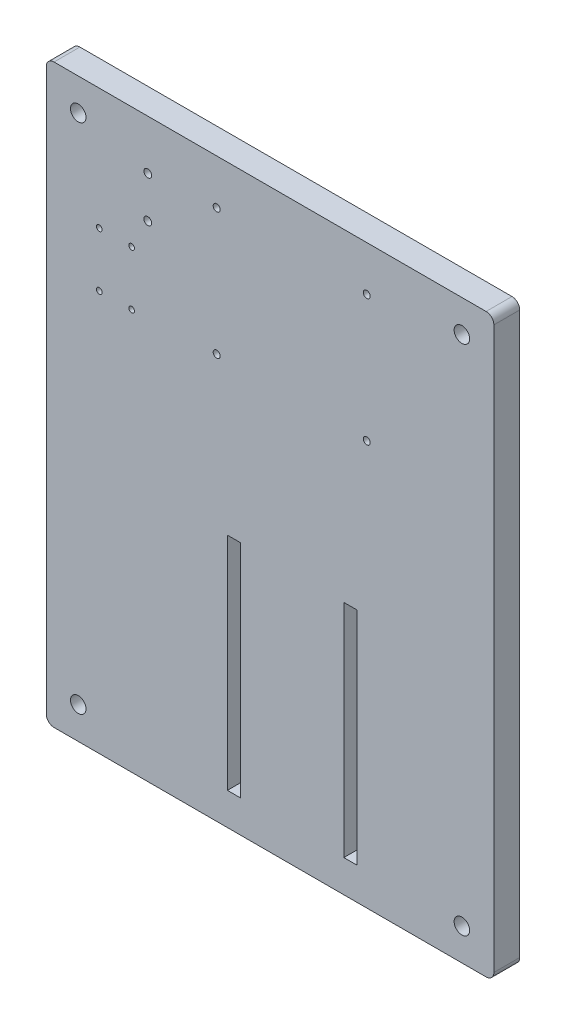
ISO-10303-21;
HEADER;
FILE_DESCRIPTION(('STEP AP214'),'2;1');
FILE_NAME('part.step','',(''),(''),'','','');
FILE_SCHEMA(('AUTOMOTIVE_DESIGN { 1 0 10303 214 1 1 1 1 }'));
ENDSEC;
DATA;
#1=APPLICATION_CONTEXT('core data for automotive mechanical design processes');
#2=APPLICATION_PROTOCOL_DEFINITION('international standard','automotive_design',2000,#1);
#3=PRODUCT_CONTEXT('',#1,'mechanical');
#4=PRODUCT('Part','Part','',(#3));
#5=PRODUCT_RELATED_PRODUCT_CATEGORY('part','',(#4));
#6=PRODUCT_DEFINITION_FORMATION('','',#4);
#7=PRODUCT_DEFINITION_CONTEXT('part definition',#1,'design');
#8=PRODUCT_DEFINITION('design','',#6,#7);
#9=PRODUCT_DEFINITION_SHAPE('','',#8);
#10=(LENGTH_UNIT() NAMED_UNIT(*) SI_UNIT(.MILLI.,.METRE.));
#11=(NAMED_UNIT(*) PLANE_ANGLE_UNIT() SI_UNIT($,.RADIAN.));
#12=(NAMED_UNIT(*) SI_UNIT($,.STERADIAN.) SOLID_ANGLE_UNIT());
#13=UNCERTAINTY_MEASURE_WITH_UNIT(LENGTH_MEASURE(1.E-05),#10,'distance_accuracy_value','');
#14=(GEOMETRIC_REPRESENTATION_CONTEXT(3) GLOBAL_UNCERTAINTY_ASSIGNED_CONTEXT((#13)) GLOBAL_UNIT_ASSIGNED_CONTEXT((#10,
#11,#12)) REPRESENTATION_CONTEXT('',''));
#15=CARTESIAN_POINT('',(0.,0.,0.));
#16=DIRECTION('',(0.,0.,1.));
#17=DIRECTION('',(1.,0.,0.));
#18=AXIS2_PLACEMENT_3D('',#15,#16,#17);
#19=CARTESIAN_POINT('',(-11.492,0.,10.));
#20=DIRECTION('',(-1.,0.,0.));
#21=DIRECTION('',(0.,0.,1.));
#22=AXIS2_PLACEMENT_3D('',#19,#20,#21);
#23=PLANE('',#22);
#24=DIRECTION('',(0.,1.,0.));
#25=VECTOR('',#24,1.);
#26=CARTESIAN_POINT('',(-11.492,0.,0.));
#27=LINE('',#26,#25);
#28=CARTESIAN_POINT('',(-11.492,-98.90673638,0.));
#29=VERTEX_POINT('',#28);
#30=CARTESIAN_POINT('',(-11.492,-13.488,0.));
#31=VERTEX_POINT('',#30);
#32=EDGE_CURVE('E265',#29,#31,#27,.T.);
#33=ORIENTED_EDGE('',*,*,#32,.F.);
#34=DIRECTION('',(0.,0.,-1.));
#35=VECTOR('',#34,1.);
#36=CARTESIAN_POINT('',(-11.492,-98.90673638,10.));
#37=LINE('',#36,#35);
#38=CARTESIAN_POINT('',(-11.492,-98.90673638,10.));
#39=VERTEX_POINT('',#38);
#40=EDGE_CURVE('E11',#39,#29,#37,.T.);
#41=ORIENTED_EDGE('',*,*,#40,.F.);
#42=DIRECTION('',(0.,1.,0.));
#43=VECTOR('',#42,1.);
#44=CARTESIAN_POINT('',(-11.492,0.,10.));
#45=LINE('',#44,#43);
#46=CARTESIAN_POINT('',(-11.492,-13.488,10.));
#47=VERTEX_POINT('',#46);
#48=EDGE_CURVE('E179',#39,#47,#45,.T.);
#49=ORIENTED_EDGE('',*,*,#48,.T.);
#50=DIRECTION('',(0.,0.,-1.));
#51=VECTOR('',#50,1.);
#52=CARTESIAN_POINT('',(-11.492,-13.488,10.));
#53=LINE('',#52,#51);
#54=EDGE_CURVE('E116',#47,#31,#53,.T.);
#55=ORIENTED_EDGE('',*,*,#54,.T.);
#56=EDGE_LOOP('',(#33,#41,#49,#55));
#57=FACE_BOUND('',#56,.T.);
#58=ADVANCED_FACE('F38',(#57),#23,.T.);
#59=CARTESIAN_POINT('',(0.,-98.90673638,10.));
#60=DIRECTION('',(0.,1.,0.));
#61=DIRECTION('',(0.,0.,1.));
#62=AXIS2_PLACEMENT_3D('',#59,#60,#61);
#63=PLANE('',#62);
#64=DIRECTION('',(1.,0.,0.));
#65=VECTOR('',#64,1.);
#66=CARTESIAN_POINT('',(0.,-98.90673638,0.));
#67=LINE('',#66,#65);
#68=CARTESIAN_POINT('',(-16.492,-98.90673638,0.));
#69=VERTEX_POINT('',#68);
#70=EDGE_CURVE('E168',#69,#29,#67,.T.);
#71=ORIENTED_EDGE('',*,*,#70,.F.);
#72=DIRECTION('',(0.,0.,-1.));
#73=VECTOR('',#72,1.);
#74=CARTESIAN_POINT('',(-16.492,-98.90673638,10.));
#75=LINE('',#74,#73);
#76=CARTESIAN_POINT('',(-16.492,-98.90673638,10.));
#77=VERTEX_POINT('',#76);
#78=EDGE_CURVE('E48',#77,#69,#75,.T.);
#79=ORIENTED_EDGE('',*,*,#78,.F.);
#80=DIRECTION('',(1.,0.,0.));
#81=VECTOR('',#80,1.);
#82=CARTESIAN_POINT('',(0.,-98.90673638,10.));
#83=LINE('',#82,#81);
#84=EDGE_CURVE('E166',#77,#39,#83,.T.);
#85=ORIENTED_EDGE('',*,*,#84,.T.);
#86=ORIENTED_EDGE('',*,*,#40,.T.);
#87=EDGE_LOOP('',(#71,#79,#85,#86));
#88=FACE_BOUND('',#87,.T.);
#89=ADVANCED_FACE('F164',(#88),#63,.T.);
#90=CARTESIAN_POINT('',(-16.492,0.,10.));
#91=DIRECTION('',(-1.,0.,0.));
#92=DIRECTION('',(0.,0.,1.));
#93=AXIS2_PLACEMENT_3D('',#90,#91,#92);
#94=PLANE('',#93);
#95=DIRECTION('',(0.,1.,0.));
#96=VECTOR('',#95,1.);
#97=CARTESIAN_POINT('',(-16.492,0.,0.));
#98=LINE('',#97,#96);
#99=CARTESIAN_POINT('',(-16.492,-13.488,0.));
#100=VERTEX_POINT('',#99);
#101=EDGE_CURVE('E268',#69,#100,#98,.T.);
#102=ORIENTED_EDGE('',*,*,#101,.T.);
#103=DIRECTION('',(0.,0.,-1.));
#104=VECTOR('',#103,1.);
#105=CARTESIAN_POINT('',(-16.492,-13.488,10.));
#106=LINE('',#105,#104);
#107=CARTESIAN_POINT('',(-16.492,-13.488,10.));
#108=VERTEX_POINT('',#107);
#109=EDGE_CURVE('E171',#108,#100,#106,.T.);
#110=ORIENTED_EDGE('',*,*,#109,.F.);
#111=DIRECTION('',(0.,1.,0.));
#112=VECTOR('',#111,1.);
#113=CARTESIAN_POINT('',(-16.492,0.,10.));
#114=LINE('',#113,#112);
#115=EDGE_CURVE('E174',#77,#108,#114,.T.);
#116=ORIENTED_EDGE('',*,*,#115,.F.);
#117=ORIENTED_EDGE('',*,*,#78,.T.);
#118=EDGE_LOOP('',(#102,#110,#116,#117));
#119=FACE_BOUND('',#118,.T.);
#120=ADVANCED_FACE('F175',(#119),#94,.F.);
#121=CARTESIAN_POINT('',(33.508,0.,10.));
#122=DIRECTION('',(-1.,0.,0.));
#123=DIRECTION('',(0.,0.,1.));
#124=AXIS2_PLACEMENT_3D('',#121,#122,#123);
#125=PLANE('',#124);
#126=DIRECTION('',(0.,1.,0.));
#127=VECTOR('',#126,1.);
#128=CARTESIAN_POINT('',(33.508,0.,0.));
#129=LINE('',#128,#127);
#130=CARTESIAN_POINT('',(33.508,-98.90673638,0.));
#131=VERTEX_POINT('',#130);
#132=CARTESIAN_POINT('',(33.508,-13.488,0.));
#133=VERTEX_POINT('',#132);
#134=EDGE_CURVE('E253',#131,#133,#129,.T.);
#135=ORIENTED_EDGE('',*,*,#134,.F.);
#136=DIRECTION('',(0.,0.,-1.));
#137=VECTOR('',#136,1.);
#138=CARTESIAN_POINT('',(33.508,-98.90673638,10.));
#139=LINE('',#138,#137);
#140=CARTESIAN_POINT('',(33.508,-98.90673638,10.));
#141=VERTEX_POINT('',#140);
#142=EDGE_CURVE('E309',#141,#131,#139,.T.);
#143=ORIENTED_EDGE('',*,*,#142,.F.);
#144=DIRECTION('',(0.,1.,0.));
#145=VECTOR('',#144,1.);
#146=CARTESIAN_POINT('',(33.508,0.,10.));
#147=LINE('',#146,#145);
#148=CARTESIAN_POINT('',(33.508,-13.488,10.));
#149=VERTEX_POINT('',#148);
#150=EDGE_CURVE('E372',#141,#149,#147,.T.);
#151=ORIENTED_EDGE('',*,*,#150,.T.);
#152=DIRECTION('',(0.,0.,-1.));
#153=VECTOR('',#152,1.);
#154=CARTESIAN_POINT('',(33.508,-13.488,10.));
#155=LINE('',#154,#153);
#156=EDGE_CURVE('E311',#149,#133,#155,.T.);
#157=ORIENTED_EDGE('',*,*,#156,.T.);
#158=EDGE_LOOP('',(#135,#143,#151,#157));
#159=FACE_BOUND('',#158,.T.);
#160=ADVANCED_FACE('F390',(#159),#125,.T.);
#161=CARTESIAN_POINT('',(0.,-98.90673638,10.));
#162=DIRECTION('',(0.,1.,0.));
#163=DIRECTION('',(0.,0.,1.));
#164=AXIS2_PLACEMENT_3D('',#161,#162,#163);
#165=PLANE('',#164);
#166=DIRECTION('',(1.,0.,0.));
#167=VECTOR('',#166,1.);
#168=CARTESIAN_POINT('',(0.,-98.90673638,0.));
#169=LINE('',#168,#167);
#170=CARTESIAN_POINT('',(28.508,-98.90673638,0.));
#171=VERTEX_POINT('',#170);
#172=EDGE_CURVE('E256',#171,#131,#169,.T.);
#173=ORIENTED_EDGE('',*,*,#172,.F.);
#174=DIRECTION('',(0.,0.,-1.));
#175=VECTOR('',#174,1.);
#176=CARTESIAN_POINT('',(28.508,-98.90673638,10.));
#177=LINE('',#176,#175);
#178=CARTESIAN_POINT('',(28.508,-98.90673638,10.));
#179=VERTEX_POINT('',#178);
#180=EDGE_CURVE('E316',#179,#171,#177,.T.);
#181=ORIENTED_EDGE('',*,*,#180,.F.);
#182=DIRECTION('',(1.,0.,0.));
#183=VECTOR('',#182,1.);
#184=CARTESIAN_POINT('',(0.,-98.90673638,10.));
#185=LINE('',#184,#183);
#186=EDGE_CURVE('E375',#179,#141,#185,.T.);
#187=ORIENTED_EDGE('',*,*,#186,.T.);
#188=ORIENTED_EDGE('',*,*,#142,.T.);
#189=EDGE_LOOP('',(#173,#181,#187,#188));
#190=FACE_BOUND('',#189,.T.);
#191=ADVANCED_FACE('F393',(#190),#165,.T.);
#192=CARTESIAN_POINT('',(28.508,0.,10.));
#193=DIRECTION('',(-1.,0.,0.));
#194=DIRECTION('',(0.,0.,1.));
#195=AXIS2_PLACEMENT_3D('',#192,#193,#194);
#196=PLANE('',#195);
#197=DIRECTION('',(0.,1.,0.));
#198=VECTOR('',#197,1.);
#199=CARTESIAN_POINT('',(28.508,0.,0.));
#200=LINE('',#199,#198);
#201=CARTESIAN_POINT('',(28.508,-13.488,0.));
#202=VERTEX_POINT('',#201);
#203=EDGE_CURVE('E259',#171,#202,#200,.T.);
#204=ORIENTED_EDGE('',*,*,#203,.T.);
#205=DIRECTION('',(0.,0.,-1.));
#206=VECTOR('',#205,1.);
#207=CARTESIAN_POINT('',(28.508,-13.488,10.));
#208=LINE('',#207,#206);
#209=CARTESIAN_POINT('',(28.508,-13.488,10.));
#210=VERTEX_POINT('',#209);
#211=EDGE_CURVE('E313',#210,#202,#208,.T.);
#212=ORIENTED_EDGE('',*,*,#211,.F.);
#213=DIRECTION('',(0.,1.,0.));
#214=VECTOR('',#213,1.);
#215=CARTESIAN_POINT('',(28.508,0.,10.));
#216=LINE('',#215,#214);
#217=EDGE_CURVE('E378',#179,#210,#216,.T.);
#218=ORIENTED_EDGE('',*,*,#217,.F.);
#219=ORIENTED_EDGE('',*,*,#180,.T.);
#220=EDGE_LOOP('',(#204,#212,#218,#219));
#221=FACE_BOUND('',#220,.T.);
#222=ADVANCED_FACE('F396',(#221),#196,.F.);
#223=CARTESIAN_POINT('',(83.492,108.366,10.));
#224=DIRECTION('',(0.,0.,-1.));
#225=DIRECTION('',(-1.,0.,0.));
#226=AXIS2_PLACEMENT_3D('',#223,#224,#225);
#227=CYLINDRICAL_SURFACE('',#226,3.);
#228=CARTESIAN_POINT('',(83.492,108.366,0.));
#229=DIRECTION('',(0.,0.,1.));
#230=DIRECTION('',(1.,0.,0.));
#231=AXIS2_PLACEMENT_3D('',#228,#229,#230);
#232=CIRCLE('',#231,3.);
#233=CARTESIAN_POINT('',(83.492,111.366,0.));
#234=VERTEX_POINT('',#233);
#235=CARTESIAN_POINT('',(86.492,108.366,0.));
#236=VERTEX_POINT('',#235);
#237=EDGE_CURVE('E229',#234,#236,#232,.F.);
#238=ORIENTED_EDGE('',*,*,#237,.F.);
#239=DIRECTION('',(0.,0.,-1.));
#240=VECTOR('',#239,1.);
#241=CARTESIAN_POINT('',(83.492,111.366,10.));
#242=LINE('',#241,#240);
#243=CARTESIAN_POINT('',(83.492,111.366,10.));
#244=VERTEX_POINT('',#243);
#245=EDGE_CURVE('E42',#244,#234,#242,.T.);
#246=ORIENTED_EDGE('',*,*,#245,.F.);
#247=CARTESIAN_POINT('',(83.492,108.366,10.));
#248=DIRECTION('',(0.,0.,1.));
#249=DIRECTION('',(1.,0.,0.));
#250=AXIS2_PLACEMENT_3D('',#247,#248,#249);
#251=CIRCLE('',#250,3.);
#252=CARTESIAN_POINT('',(86.492,108.366,10.));
#253=VERTEX_POINT('',#252);
#254=EDGE_CURVE('E490',#244,#253,#251,.F.);
#255=ORIENTED_EDGE('',*,*,#254,.T.);
#256=DIRECTION('',(0.,0.,-1.));
#257=VECTOR('',#256,1.);
#258=CARTESIAN_POINT('',(86.492,108.366,10.));
#259=LINE('',#258,#257);
#260=EDGE_CURVE('E222',#253,#236,#259,.T.);
#261=ORIENTED_EDGE('',*,*,#260,.T.);
#262=EDGE_LOOP('',(#238,#246,#255,#261));
#263=FACE_BOUND('',#262,.T.);
#264=ADVANCED_FACE('F341',(#263),#227,.T.);
#265=CARTESIAN_POINT('',(0.,111.366,10.));
#266=DIRECTION('',(0.,1.,0.));
#267=DIRECTION('',(0.,0.,1.));
#268=AXIS2_PLACEMENT_3D('',#265,#266,#267);
#269=PLANE('',#268);
#270=DIRECTION('',(1.,0.,0.));
#271=VECTOR('',#270,1.);
#272=CARTESIAN_POINT('',(0.,111.366,0.));
#273=LINE('',#272,#271);
#274=CARTESIAN_POINT('',(-83.492,111.366,0.));
#275=VERTEX_POINT('',#274);
#276=EDGE_CURVE('E232',#275,#234,#273,.T.);
#277=ORIENTED_EDGE('',*,*,#276,.F.);
#278=DIRECTION('',(0.,0.,-1.));
#279=VECTOR('',#278,1.);
#280=CARTESIAN_POINT('',(-83.492,111.366,10.));
#281=LINE('',#280,#279);
#282=CARTESIAN_POINT('',(-83.492,111.366,10.));
#283=VERTEX_POINT('',#282);
#284=EDGE_CURVE('E331',#283,#275,#281,.T.);
#285=ORIENTED_EDGE('',*,*,#284,.F.);
#286=DIRECTION('',(1.,0.,0.));
#287=VECTOR('',#286,1.);
#288=CARTESIAN_POINT('',(0.,111.366,10.));
#289=LINE('',#288,#287);
#290=EDGE_CURVE('E340',#283,#244,#289,.T.);
#291=ORIENTED_EDGE('',*,*,#290,.T.);
#292=ORIENTED_EDGE('',*,*,#245,.T.);
#293=EDGE_LOOP('',(#277,#285,#291,#292));
#294=FACE_BOUND('',#293,.T.);
#295=ADVANCED_FACE('F338',(#294),#269,.T.);
#296=CARTESIAN_POINT('',(-83.492,108.366,10.));
#297=DIRECTION('',(0.,0.,-1.));
#298=DIRECTION('',(-1.,0.,0.));
#299=AXIS2_PLACEMENT_3D('',#296,#297,#298);
#300=CYLINDRICAL_SURFACE('',#299,3.);
#301=CARTESIAN_POINT('',(-83.492,108.366,0.));
#302=DIRECTION('',(0.,0.,1.));
#303=DIRECTION('',(1.,0.,0.));
#304=AXIS2_PLACEMENT_3D('',#301,#302,#303);
#305=CIRCLE('',#304,3.);
#306=CARTESIAN_POINT('',(-86.492,108.366,0.));
#307=VERTEX_POINT('',#306);
#308=EDGE_CURVE('E235',#275,#307,#305,.T.);
#309=ORIENTED_EDGE('',*,*,#308,.T.);
#310=DIRECTION('',(0.,0.,-1.));
#311=VECTOR('',#310,1.);
#312=CARTESIAN_POINT('',(-86.492,108.366,10.));
#313=LINE('',#312,#311);
#314=CARTESIAN_POINT('',(-86.492,108.366,10.));
#315=VERTEX_POINT('',#314);
#316=EDGE_CURVE('E330',#315,#307,#313,.T.);
#317=ORIENTED_EDGE('',*,*,#316,.F.);
#318=CARTESIAN_POINT('',(-83.492,108.366,10.));
#319=DIRECTION('',(0.,0.,1.));
#320=DIRECTION('',(1.,0.,0.));
#321=AXIS2_PLACEMENT_3D('',#318,#319,#320);
#322=CIRCLE('',#321,3.);
#323=EDGE_CURVE('E350',#283,#315,#322,.T.);
#324=ORIENTED_EDGE('',*,*,#323,.F.);
#325=ORIENTED_EDGE('',*,*,#284,.T.);
#326=EDGE_LOOP('',(#309,#317,#324,#325));
#327=FACE_BOUND('',#326,.T.);
#328=ADVANCED_FACE('F348',(#327),#300,.T.);
#329=CARTESIAN_POINT('',(-86.492,0.,10.));
#330=DIRECTION('',(-1.,0.,0.));
#331=DIRECTION('',(0.,0.,1.));
#332=AXIS2_PLACEMENT_3D('',#329,#330,#331);
#333=PLANE('',#332);
#334=DIRECTION('',(0.,1.,0.));
#335=VECTOR('',#334,1.);
#336=CARTESIAN_POINT('',(-86.492,0.,0.));
#337=LINE('',#336,#335);
#338=CARTESIAN_POINT('',(-86.492,-108.366,0.));
#339=VERTEX_POINT('',#338);
#340=EDGE_CURVE('E238',#339,#307,#337,.T.);
#341=ORIENTED_EDGE('',*,*,#340,.F.);
#342=DIRECTION('',(0.,0.,-1.));
#343=VECTOR('',#342,1.);
#344=CARTESIAN_POINT('',(-86.492,-108.366,10.));
#345=LINE('',#344,#343);
#346=CARTESIAN_POINT('',(-86.492,-108.366,10.));
#347=VERTEX_POINT('',#346);
#348=EDGE_CURVE('E328',#347,#339,#345,.T.);
#349=ORIENTED_EDGE('',*,*,#348,.F.);
#350=DIRECTION('',(0.,1.,0.));
#351=VECTOR('',#350,1.);
#352=CARTESIAN_POINT('',(-86.492,0.,10.));
#353=LINE('',#352,#351);
#354=EDGE_CURVE('E353',#347,#315,#353,.T.);
#355=ORIENTED_EDGE('',*,*,#354,.T.);
#356=ORIENTED_EDGE('',*,*,#316,.T.);
#357=EDGE_LOOP('',(#341,#349,#355,#356));
#358=FACE_BOUND('',#357,.T.);
#359=ADVANCED_FACE('F354',(#358),#333,.T.);
#360=CARTESIAN_POINT('',(-83.492,-108.366,10.));
#361=DIRECTION('',(0.,0.,-1.));
#362=DIRECTION('',(-1.,0.,0.));
#363=AXIS2_PLACEMENT_3D('',#360,#361,#362);
#364=CYLINDRICAL_SURFACE('',#363,3.);
#365=CARTESIAN_POINT('',(-83.492,-108.366,0.));
#366=DIRECTION('',(0.,0.,1.));
#367=DIRECTION('',(1.,0.,0.));
#368=AXIS2_PLACEMENT_3D('',#365,#366,#367);
#369=CIRCLE('',#368,3.);
#370=CARTESIAN_POINT('',(-83.492,-111.366,0.));
#371=VERTEX_POINT('',#370);
#372=EDGE_CURVE('E241',#371,#339,#369,.F.);
#373=ORIENTED_EDGE('',*,*,#372,.F.);
#374=DIRECTION('',(0.,0.,-1.));
#375=VECTOR('',#374,1.);
#376=CARTESIAN_POINT('',(-83.492,-111.366,10.));
#377=LINE('',#376,#375);
#378=CARTESIAN_POINT('',(-83.492,-111.366,10.));
#379=VERTEX_POINT('',#378);
#380=EDGE_CURVE('E326',#379,#371,#377,.T.);
#381=ORIENTED_EDGE('',*,*,#380,.F.);
#382=CARTESIAN_POINT('',(-83.492,-108.366,10.));
#383=DIRECTION('',(0.,0.,1.));
#384=DIRECTION('',(1.,0.,0.));
#385=AXIS2_PLACEMENT_3D('',#382,#383,#384);
#386=CIRCLE('',#385,3.);
#387=EDGE_CURVE('E358',#379,#347,#386,.F.);
#388=ORIENTED_EDGE('',*,*,#387,.T.);
#389=ORIENTED_EDGE('',*,*,#348,.T.);
#390=EDGE_LOOP('',(#373,#381,#388,#389));
#391=FACE_BOUND('',#390,.T.);
#392=ADVANCED_FACE('F467',(#391),#364,.T.);
#393=CARTESIAN_POINT('',(0.,-111.366,10.));
#394=DIRECTION('',(0.,1.,0.));
#395=DIRECTION('',(0.,0.,1.));
#396=AXIS2_PLACEMENT_3D('',#393,#394,#395);
#397=PLANE('',#396);
#398=DIRECTION('',(1.,0.,0.));
#399=VECTOR('',#398,1.);
#400=CARTESIAN_POINT('',(0.,-111.366,0.));
#401=LINE('',#400,#399);
#402=CARTESIAN_POINT('',(83.492,-111.366,0.));
#403=VERTEX_POINT('',#402);
#404=EDGE_CURVE('E244',#371,#403,#401,.T.);
#405=ORIENTED_EDGE('',*,*,#404,.T.);
#406=DIRECTION('',(0.,0.,-1.));
#407=VECTOR('',#406,1.);
#408=CARTESIAN_POINT('',(83.492,-111.366,10.));
#409=LINE('',#408,#407);
#410=CARTESIAN_POINT('',(83.492,-111.366,10.));
#411=VERTEX_POINT('',#410);
#412=EDGE_CURVE('E323',#411,#403,#409,.T.);
#413=ORIENTED_EDGE('',*,*,#412,.F.);
#414=DIRECTION('',(1.,0.,0.));
#415=VECTOR('',#414,1.);
#416=CARTESIAN_POINT('',(0.,-111.366,10.));
#417=LINE('',#416,#415);
#418=EDGE_CURVE('E360',#379,#411,#417,.T.);
#419=ORIENTED_EDGE('',*,*,#418,.F.);
#420=ORIENTED_EDGE('',*,*,#380,.T.);
#421=EDGE_LOOP('',(#405,#413,#419,#420));
#422=FACE_BOUND('',#421,.T.);
#423=ADVANCED_FACE('F463',(#422),#397,.F.);
#424=CARTESIAN_POINT('',(83.492,-108.366,10.));
#425=DIRECTION('',(0.,0.,-1.));
#426=DIRECTION('',(-1.,0.,0.));
#427=AXIS2_PLACEMENT_3D('',#424,#425,#426);
#428=CYLINDRICAL_SURFACE('',#427,3.);
#429=CARTESIAN_POINT('',(83.492,-108.366,0.));
#430=DIRECTION('',(0.,0.,1.));
#431=DIRECTION('',(1.,0.,0.));
#432=AXIS2_PLACEMENT_3D('',#429,#430,#431);
#433=CIRCLE('',#432,3.);
#434=CARTESIAN_POINT('',(86.492,-108.366,0.));
#435=VERTEX_POINT('',#434);
#436=EDGE_CURVE('E247',#403,#435,#433,.T.);
#437=ORIENTED_EDGE('',*,*,#436,.T.);
#438=DIRECTION('',(0.,0.,-1.));
#439=VECTOR('',#438,1.);
#440=CARTESIAN_POINT('',(86.492,-108.366,10.));
#441=LINE('',#440,#439);
#442=CARTESIAN_POINT('',(86.492,-108.366,10.));
#443=VERTEX_POINT('',#442);
#444=EDGE_CURVE('E320',#443,#435,#441,.T.);
#445=ORIENTED_EDGE('',*,*,#444,.F.);
#446=CARTESIAN_POINT('',(83.492,-108.366,10.));
#447=DIRECTION('',(0.,0.,1.));
#448=DIRECTION('',(1.,0.,0.));
#449=AXIS2_PLACEMENT_3D('',#446,#447,#448);
#450=CIRCLE('',#449,3.);
#451=EDGE_CURVE('E367',#411,#443,#450,.T.);
#452=ORIENTED_EDGE('',*,*,#451,.F.);
#453=ORIENTED_EDGE('',*,*,#412,.T.);
#454=EDGE_LOOP('',(#437,#445,#452,#453));
#455=FACE_BOUND('',#454,.T.);
#456=ADVANCED_FACE('F459',(#455),#428,.T.);
#457=CARTESIAN_POINT('',(37.364,45.012,10.));
#458=DIRECTION('',(0.,0.,-1.));
#459=DIRECTION('',(-1.,0.,0.));
#460=AXIS2_PLACEMENT_3D('',#457,#458,#459);
#461=CYLINDRICAL_SURFACE('',#460,1.35);
#462=CARTESIAN_POINT('',(37.364,45.012,10.));
#463=DIRECTION('',(0.,0.,1.));
#464=DIRECTION('',(1.,0.,0.));
#465=AXIS2_PLACEMENT_3D('',#462,#463,#464);
#466=CIRCLE('',#465,1.35);
#467=CARTESIAN_POINT('',(38.714,45.012,10.));
#468=VERTEX_POINT('',#467);
#469=EDGE_CURVE('E216',#468,#468,#466,.T.);
#470=ORIENTED_EDGE('',*,*,#469,.T.);
#471=EDGE_LOOP('',(#470));
#472=FACE_BOUND('',#471,.T.);
#473=CARTESIAN_POINT('',(37.364,45.012,0.));
#474=DIRECTION('',(0.,0.,1.));
#475=DIRECTION('',(1.,0.,0.));
#476=AXIS2_PLACEMENT_3D('',#473,#474,#475);
#477=CIRCLE('',#476,1.35);
#478=CARTESIAN_POINT('',(38.714,45.012,0.));
#479=VERTEX_POINT('',#478);
#480=EDGE_CURVE('E301',#479,#479,#477,.T.);
#481=ORIENTED_EDGE('',*,*,#480,.F.);
#482=EDGE_LOOP('',(#481));
#483=FACE_BOUND('',#482,.T.);
#484=ADVANCED_FACE('F462',(#472,#483),#461,.F.);
#485=CARTESIAN_POINT('',(37.364,94.012,10.));
#486=DIRECTION('',(0.,0.,-1.));
#487=DIRECTION('',(-1.,0.,0.));
#488=AXIS2_PLACEMENT_3D('',#485,#486,#487);
#489=CYLINDRICAL_SURFACE('',#488,1.35);
#490=CARTESIAN_POINT('',(37.364,94.012,10.));
#491=DIRECTION('',(0.,0.,1.));
#492=DIRECTION('',(1.,0.,0.));
#493=AXIS2_PLACEMENT_3D('',#490,#491,#492);
#494=CIRCLE('',#493,1.35);
#495=CARTESIAN_POINT('',(38.714,94.012,10.));
#496=VERTEX_POINT('',#495);
#497=EDGE_CURVE('E213',#496,#496,#494,.T.);
#498=ORIENTED_EDGE('',*,*,#497,.T.);
#499=EDGE_LOOP('',(#498));
#500=FACE_BOUND('',#499,.T.);
#501=CARTESIAN_POINT('',(37.364,94.012,0.));
#502=DIRECTION('',(0.,0.,1.));
#503=DIRECTION('',(1.,0.,0.));
#504=AXIS2_PLACEMENT_3D('',#501,#502,#503);
#505=CIRCLE('',#504,1.35);
#506=CARTESIAN_POINT('',(38.714,94.012,0.));
#507=VERTEX_POINT('',#506);
#508=EDGE_CURVE('E298',#507,#507,#505,.T.);
#509=ORIENTED_EDGE('',*,*,#508,.F.);
#510=EDGE_LOOP('',(#509));
#511=FACE_BOUND('',#510,.T.);
#512=ADVANCED_FACE('F661',(#500,#511),#489,.F.);
#513=CARTESIAN_POINT('',(-20.636,94.012,10.));
#514=DIRECTION('',(0.,0.,-1.));
#515=DIRECTION('',(-1.,0.,0.));
#516=AXIS2_PLACEMENT_3D('',#513,#514,#515);
#517=CYLINDRICAL_SURFACE('',#516,1.35);
#518=CARTESIAN_POINT('',(-20.636,94.012,10.));
#519=DIRECTION('',(0.,0.,1.));
#520=DIRECTION('',(1.,0.,0.));
#521=AXIS2_PLACEMENT_3D('',#518,#519,#520);
#522=CIRCLE('',#521,1.35);
#523=CARTESIAN_POINT('',(-19.286,94.012,10.));
#524=VERTEX_POINT('',#523);
#525=EDGE_CURVE('E210',#524,#524,#522,.T.);
#526=ORIENTED_EDGE('',*,*,#525,.T.);
#527=EDGE_LOOP('',(#526));
#528=FACE_BOUND('',#527,.T.);
#529=CARTESIAN_POINT('',(-20.636,94.012,0.));
#530=DIRECTION('',(0.,0.,1.));
#531=DIRECTION('',(1.,0.,0.));
#532=AXIS2_PLACEMENT_3D('',#529,#530,#531);
#533=CIRCLE('',#532,1.35);
#534=CARTESIAN_POINT('',(-19.286,94.012,0.));
#535=VERTEX_POINT('',#534);
#536=EDGE_CURVE('E295',#535,#535,#533,.T.);
#537=ORIENTED_EDGE('',*,*,#536,.F.);
#538=EDGE_LOOP('',(#537));
#539=FACE_BOUND('',#538,.T.);
#540=ADVANCED_FACE('F651',(#528,#539),#517,.F.);
#541=CARTESIAN_POINT('',(-65.998,64.512,10.));
#542=DIRECTION('',(0.,0.,-1.));
#543=DIRECTION('',(-1.,0.,0.));
#544=AXIS2_PLACEMENT_3D('',#541,#542,#543);
#545=CYLINDRICAL_SURFACE('',#544,1.10000000000001);
#546=CARTESIAN_POINT('',(-65.998,64.512,10.));
#547=DIRECTION('',(0.,0.,1.));
#548=DIRECTION('',(1.,0.,0.));
#549=AXIS2_PLACEMENT_3D('',#546,#547,#548);
#550=CIRCLE('',#549,1.10000000000001);
#551=CARTESIAN_POINT('',(-64.898,64.512,10.));
#552=VERTEX_POINT('',#551);
#553=EDGE_CURVE('E207',#552,#552,#550,.F.);
#554=ORIENTED_EDGE('',*,*,#553,.F.);
#555=EDGE_LOOP('',(#554));
#556=FACE_BOUND('',#555,.T.);
#557=CARTESIAN_POINT('',(-65.998,64.512,0.));
#558=DIRECTION('',(0.,0.,1.));
#559=DIRECTION('',(1.,0.,0.));
#560=AXIS2_PLACEMENT_3D('',#557,#558,#559);
#561=CIRCLE('',#560,1.10000000000001);
#562=CARTESIAN_POINT('',(-64.898,64.512,0.));
#563=VERTEX_POINT('',#562);
#564=EDGE_CURVE('E292',#563,#563,#561,.F.);
#565=ORIENTED_EDGE('',*,*,#564,.T.);
#566=EDGE_LOOP('',(#565));
#567=FACE_BOUND('',#566,.T.);
#568=ADVANCED_FACE('F641',(#556,#567),#545,.F.);
#569=CARTESIAN_POINT('',(-65.998,43.512,10.));
#570=DIRECTION('',(0.,0.,-1.));
#571=DIRECTION('',(-1.,0.,0.));
#572=AXIS2_PLACEMENT_3D('',#569,#570,#571);
#573=CYLINDRICAL_SURFACE('',#572,1.10000000000001);
#574=CARTESIAN_POINT('',(-65.998,43.512,10.));
#575=DIRECTION('',(0.,0.,1.));
#576=DIRECTION('',(1.,0.,0.));
#577=AXIS2_PLACEMENT_3D('',#574,#575,#576);
#578=CIRCLE('',#577,1.10000000000001);
#579=CARTESIAN_POINT('',(-64.898,43.512,10.));
#580=VERTEX_POINT('',#579);
#581=EDGE_CURVE('E204',#580,#580,#578,.T.);
#582=ORIENTED_EDGE('',*,*,#581,.T.);
#583=EDGE_LOOP('',(#582));
#584=FACE_BOUND('',#583,.T.);
#585=CARTESIAN_POINT('',(-65.998,43.512,0.));
#586=DIRECTION('',(0.,0.,1.));
#587=DIRECTION('',(1.,0.,0.));
#588=AXIS2_PLACEMENT_3D('',#585,#586,#587);
#589=CIRCLE('',#588,1.10000000000001);
#590=CARTESIAN_POINT('',(-64.898,43.512,0.));
#591=VERTEX_POINT('',#590);
#592=EDGE_CURVE('E289',#591,#591,#589,.T.);
#593=ORIENTED_EDGE('',*,*,#592,.F.);
#594=EDGE_LOOP('',(#593));
#595=FACE_BOUND('',#594,.T.);
#596=ADVANCED_FACE('F631',(#584,#595),#573,.F.);
#597=CARTESIAN_POINT('',(-53.498,43.512,10.));
#598=DIRECTION('',(0.,0.,-1.));
#599=DIRECTION('',(-1.,0.,0.));
#600=AXIS2_PLACEMENT_3D('',#597,#598,#599);
#601=CYLINDRICAL_SURFACE('',#600,1.1);
#602=CARTESIAN_POINT('',(-53.498,43.512,10.));
#603=DIRECTION('',(0.,0.,1.));
#604=DIRECTION('',(1.,0.,0.));
#605=AXIS2_PLACEMENT_3D('',#602,#603,#604);
#606=CIRCLE('',#605,1.1);
#607=CARTESIAN_POINT('',(-52.398,43.512,10.));
#608=VERTEX_POINT('',#607);
#609=EDGE_CURVE('E201',#608,#608,#606,.T.);
#610=ORIENTED_EDGE('',*,*,#609,.T.);
#611=EDGE_LOOP('',(#610));
#612=FACE_BOUND('',#611,.T.);
#613=CARTESIAN_POINT('',(-53.498,43.512,0.));
#614=DIRECTION('',(0.,0.,1.));
#615=DIRECTION('',(1.,0.,0.));
#616=AXIS2_PLACEMENT_3D('',#613,#614,#615);
#617=CIRCLE('',#616,1.1);
#618=CARTESIAN_POINT('',(-52.398,43.512,0.));
#619=VERTEX_POINT('',#618);
#620=EDGE_CURVE('E286',#619,#619,#617,.T.);
#621=ORIENTED_EDGE('',*,*,#620,.F.);
#622=EDGE_LOOP('',(#621));
#623=FACE_BOUND('',#622,.T.);
#624=ADVANCED_FACE('F621',(#612,#623),#601,.F.);
#625=CARTESIAN_POINT('',(-53.498,64.512,10.));
#626=DIRECTION('',(0.,0.,-1.));
#627=DIRECTION('',(-1.,0.,0.));
#628=AXIS2_PLACEMENT_3D('',#625,#626,#627);
#629=CYLINDRICAL_SURFACE('',#628,1.1);
#630=CARTESIAN_POINT('',(-53.498,64.512,10.));
#631=DIRECTION('',(0.,0.,1.));
#632=DIRECTION('',(1.,0.,0.));
#633=AXIS2_PLACEMENT_3D('',#630,#631,#632);
#634=CIRCLE('',#633,1.1);
#635=CARTESIAN_POINT('',(-52.398,64.512,10.));
#636=VERTEX_POINT('',#635);
#637=EDGE_CURVE('E198',#636,#636,#634,.F.);
#638=ORIENTED_EDGE('',*,*,#637,.F.);
#639=EDGE_LOOP('',(#638));
#640=FACE_BOUND('',#639,.T.);
#641=CARTESIAN_POINT('',(-53.498,64.512,0.));
#642=DIRECTION('',(0.,0.,1.));
#643=DIRECTION('',(1.,0.,0.));
#644=AXIS2_PLACEMENT_3D('',#641,#642,#643);
#645=CIRCLE('',#644,1.1);
#646=CARTESIAN_POINT('',(-52.398,64.512,0.));
#647=VERTEX_POINT('',#646);
#648=EDGE_CURVE('E283',#647,#647,#645,.F.);
#649=ORIENTED_EDGE('',*,*,#648,.T.);
#650=EDGE_LOOP('',(#649));
#651=FACE_BOUND('',#650,.T.);
#652=ADVANCED_FACE('F611',(#640,#651),#629,.F.);
#653=CARTESIAN_POINT('',(-47.26410382,76.25530339,10.));
#654=DIRECTION('',(0.,0.,-1.));
#655=DIRECTION('',(-1.,0.,0.));
#656=AXIS2_PLACEMENT_3D('',#653,#654,#655);
#657=CYLINDRICAL_SURFACE('',#656,1.5);
#658=CARTESIAN_POINT('',(-47.26410382,76.25530339,10.));
#659=DIRECTION('',(0.,0.,1.));
#660=DIRECTION('',(1.,0.,0.));
#661=AXIS2_PLACEMENT_3D('',#658,#659,#660);
#662=CIRCLE('',#661,1.5);
#663=CARTESIAN_POINT('',(-45.76410382,76.25530339,10.));
#664=VERTEX_POINT('',#663);
#665=EDGE_CURVE('E195',#664,#664,#662,.F.);
#666=ORIENTED_EDGE('',*,*,#665,.F.);
#667=EDGE_LOOP('',(#666));
#668=FACE_BOUND('',#667,.T.);
#669=CARTESIAN_POINT('',(-47.26410382,76.25530339,0.));
#670=DIRECTION('',(0.,0.,1.));
#671=DIRECTION('',(1.,0.,0.));
#672=AXIS2_PLACEMENT_3D('',#669,#670,#671);
#673=CIRCLE('',#672,1.5);
#674=CARTESIAN_POINT('',(-45.76410382,76.25530339,0.));
#675=VERTEX_POINT('',#674);
#676=EDGE_CURVE('E280',#675,#675,#673,.F.);
#677=ORIENTED_EDGE('',*,*,#676,.T.);
#678=EDGE_LOOP('',(#677));
#679=FACE_BOUND('',#678,.T.);
#680=ADVANCED_FACE('F601',(#668,#679),#657,.F.);
#681=CARTESIAN_POINT('',(-47.26410382,92.23269661,10.));
#682=DIRECTION('',(0.,0.,-1.));
#683=DIRECTION('',(-1.,0.,0.));
#684=AXIS2_PLACEMENT_3D('',#681,#682,#683);
#685=CYLINDRICAL_SURFACE('',#684,1.5);
#686=CARTESIAN_POINT('',(-47.26410382,92.23269661,10.));
#687=DIRECTION('',(0.,0.,1.));
#688=DIRECTION('',(1.,0.,0.));
#689=AXIS2_PLACEMENT_3D('',#686,#687,#688);
#690=CIRCLE('',#689,1.5);
#691=CARTESIAN_POINT('',(-45.76410382,92.23269661,10.));
#692=VERTEX_POINT('',#691);
#693=EDGE_CURVE('E192',#692,#692,#690,.T.);
#694=ORIENTED_EDGE('',*,*,#693,.T.);
#695=EDGE_LOOP('',(#694));
#696=FACE_BOUND('',#695,.T.);
#697=CARTESIAN_POINT('',(-47.26410382,92.23269661,0.));
#698=DIRECTION('',(0.,0.,1.));
#699=DIRECTION('',(1.,0.,0.));
#700=AXIS2_PLACEMENT_3D('',#697,#698,#699);
#701=CIRCLE('',#700,1.5);
#702=CARTESIAN_POINT('',(-45.76410382,92.23269661,0.));
#703=VERTEX_POINT('',#702);
#704=EDGE_CURVE('E277',#703,#703,#701,.T.);
#705=ORIENTED_EDGE('',*,*,#704,.F.);
#706=EDGE_LOOP('',(#705));
#707=FACE_BOUND('',#706,.T.);
#708=ADVANCED_FACE('F591',(#696,#707),#685,.F.);
#709=CARTESIAN_POINT('',(-74.136,-98.9919999999999,10.));
#710=DIRECTION('',(0.,0.,-1.));
#711=DIRECTION('',(-1.,0.,0.));
#712=AXIS2_PLACEMENT_3D('',#709,#710,#711);
#713=CYLINDRICAL_SURFACE('',#712,3.00000000000001);
#714=CARTESIAN_POINT('',(-74.136,-98.9919999999999,10.));
#715=DIRECTION('',(0.,0.,1.));
#716=DIRECTION('',(1.,0.,0.));
#717=AXIS2_PLACEMENT_3D('',#714,#715,#716);
#718=CIRCLE('',#717,3.00000000000001);
#719=CARTESIAN_POINT('',(-71.136,-98.9919999999999,10.));
#720=VERTEX_POINT('',#719);
#721=EDGE_CURVE('E189',#720,#720,#718,.F.);
#722=ORIENTED_EDGE('',*,*,#721,.F.);
#723=EDGE_LOOP('',(#722));
#724=FACE_BOUND('',#723,.T.);
#725=CARTESIAN_POINT('',(-74.136,-98.9919999999999,0.));
#726=DIRECTION('',(0.,0.,1.));
#727=DIRECTION('',(1.,0.,0.));
#728=AXIS2_PLACEMENT_3D('',#725,#726,#727);
#729=CIRCLE('',#728,3.00000000000001);
#730=CARTESIAN_POINT('',(-71.136,-98.9919999999999,0.));
#731=VERTEX_POINT('',#730);
#732=EDGE_CURVE('E274',#731,#731,#729,.F.);
#733=ORIENTED_EDGE('',*,*,#732,.T.);
#734=EDGE_LOOP('',(#733));
#735=FACE_BOUND('',#734,.T.);
#736=ADVANCED_FACE('F581',(#724,#735),#713,.F.);
#737=CARTESIAN_POINT('',(74.136,-98.9919999999999,10.));
#738=DIRECTION('',(0.,0.,-1.));
#739=DIRECTION('',(-1.,0.,0.));
#740=AXIS2_PLACEMENT_3D('',#737,#738,#739);
#741=CYLINDRICAL_SURFACE('',#740,3.00000000000001);
#742=CARTESIAN_POINT('',(74.136,-98.9919999999999,10.));
#743=DIRECTION('',(0.,0.,1.));
#744=DIRECTION('',(1.,0.,0.));
#745=AXIS2_PLACEMENT_3D('',#742,#743,#744);
#746=CIRCLE('',#745,3.00000000000001);
#747=CARTESIAN_POINT('',(77.136,-98.9919999999999,10.));
#748=VERTEX_POINT('',#747);
#749=EDGE_CURVE('E186',#748,#748,#746,.T.);
#750=ORIENTED_EDGE('',*,*,#749,.T.);
#751=EDGE_LOOP('',(#750));
#752=FACE_BOUND('',#751,.T.);
#753=CARTESIAN_POINT('',(74.136,-98.9919999999999,0.));
#754=DIRECTION('',(0.,0.,1.));
#755=DIRECTION('',(1.,0.,0.));
#756=AXIS2_PLACEMENT_3D('',#753,#754,#755);
#757=CIRCLE('',#756,3.00000000000001);
#758=CARTESIAN_POINT('',(77.136,-98.9919999999999,0.));
#759=VERTEX_POINT('',#758);
#760=EDGE_CURVE('E271',#759,#759,#757,.T.);
#761=ORIENTED_EDGE('',*,*,#760,.F.);
#762=EDGE_LOOP('',(#761));
#763=FACE_BOUND('',#762,.T.);
#764=ADVANCED_FACE('F571',(#752,#763),#741,.F.);
#765=CARTESIAN_POINT('',(0.,-13.488,10.));
#766=DIRECTION('',(0.,1.,0.));
#767=DIRECTION('',(0.,0.,1.));
#768=AXIS2_PLACEMENT_3D('',#765,#766,#767);
#769=PLANE('',#768);
#770=DIRECTION('',(1.,0.,0.));
#771=VECTOR('',#770,1.);
#772=CARTESIAN_POINT('',(0.,-13.488,0.));
#773=LINE('',#772,#771);
#774=EDGE_CURVE('E109',#100,#31,#773,.T.);
#775=ORIENTED_EDGE('',*,*,#774,.T.);
#776=ORIENTED_EDGE('',*,*,#54,.F.);
#777=DIRECTION('',(1.,0.,0.));
#778=VECTOR('',#777,1.);
#779=CARTESIAN_POINT('',(0.,-13.488,10.));
#780=LINE('',#779,#778);
#781=EDGE_CURVE('E57',#108,#47,#780,.T.);
#782=ORIENTED_EDGE('',*,*,#781,.F.);
#783=ORIENTED_EDGE('',*,*,#109,.T.);
#784=EDGE_LOOP('',(#775,#776,#782,#783));
#785=FACE_BOUND('',#784,.T.);
#786=ADVANCED_FACE('F449',(#785),#769,.F.);
#787=CARTESIAN_POINT('',(0.,-13.488,10.));
#788=DIRECTION('',(0.,1.,0.));
#789=DIRECTION('',(0.,0.,1.));
#790=AXIS2_PLACEMENT_3D('',#787,#788,#789);
#791=PLANE('',#790);
#792=DIRECTION('',(1.,0.,0.));
#793=VECTOR('',#792,1.);
#794=CARTESIAN_POINT('',(0.,-13.488,0.));
#795=LINE('',#794,#793);
#796=EDGE_CURVE('E262',#202,#133,#795,.T.);
#797=ORIENTED_EDGE('',*,*,#796,.T.);
#798=ORIENTED_EDGE('',*,*,#156,.F.);
#799=DIRECTION('',(1.,0.,0.));
#800=VECTOR('',#799,1.);
#801=CARTESIAN_POINT('',(0.,-13.488,10.));
#802=LINE('',#801,#800);
#803=EDGE_CURVE('E181',#210,#149,#802,.T.);
#804=ORIENTED_EDGE('',*,*,#803,.F.);
#805=ORIENTED_EDGE('',*,*,#211,.T.);
#806=EDGE_LOOP('',(#797,#798,#804,#805));
#807=FACE_BOUND('',#806,.T.);
#808=ADVANCED_FACE('F387',(#807),#791,.F.);
#809=CARTESIAN_POINT('',(86.492,0.,10.));
#810=DIRECTION('',(-1.,0.,0.));
#811=DIRECTION('',(0.,0.,1.));
#812=AXIS2_PLACEMENT_3D('',#809,#810,#811);
#813=PLANE('',#812);
#814=DIRECTION('',(0.,1.,0.));
#815=VECTOR('',#814,1.);
#816=CARTESIAN_POINT('',(86.492,0.,0.));
#817=LINE('',#816,#815);
#818=EDGE_CURVE('E250',#435,#236,#817,.T.);
#819=ORIENTED_EDGE('',*,*,#818,.T.);
#820=ORIENTED_EDGE('',*,*,#260,.F.);
#821=DIRECTION('',(0.,1.,0.));
#822=VECTOR('',#821,1.);
#823=CARTESIAN_POINT('',(86.492,0.,10.));
#824=LINE('',#823,#822);
#825=EDGE_CURVE('E370',#443,#253,#824,.T.);
#826=ORIENTED_EDGE('',*,*,#825,.F.);
#827=ORIENTED_EDGE('',*,*,#444,.T.);
#828=EDGE_LOOP('',(#819,#820,#826,#827));
#829=FACE_BOUND('',#828,.T.);
#830=ADVANCED_FACE('F448',(#829),#813,.F.);
#831=CARTESIAN_POINT('',(-74.136,98.992,10.));
#832=DIRECTION('',(0.,0.,-1.));
#833=DIRECTION('',(-1.,0.,0.));
#834=AXIS2_PLACEMENT_3D('',#831,#832,#833);
#835=CYLINDRICAL_SURFACE('',#834,3.00000000000001);
#836=CARTESIAN_POINT('',(-74.136,98.992,10.));
#837=DIRECTION('',(0.,0.,1.));
#838=DIRECTION('',(1.,0.,0.));
#839=AXIS2_PLACEMENT_3D('',#836,#837,#838);
#840=CIRCLE('',#839,3.00000000000001);
#841=CARTESIAN_POINT('',(-71.136,98.992,10.));
#842=VERTEX_POINT('',#841);
#843=EDGE_CURVE('E486',#842,#842,#840,.T.);
#844=ORIENTED_EDGE('',*,*,#843,.T.);
#845=EDGE_LOOP('',(#844));
#846=FACE_BOUND('',#845,.T.);
#847=CARTESIAN_POINT('',(-74.136,98.992,0.));
#848=DIRECTION('',(0.,0.,1.));
#849=DIRECTION('',(1.,0.,0.));
#850=AXIS2_PLACEMENT_3D('',#847,#848,#849);
#851=CIRCLE('',#850,3.00000000000001);
#852=CARTESIAN_POINT('',(-71.136,98.992,0.));
#853=VERTEX_POINT('',#852);
#854=EDGE_CURVE('E226',#853,#853,#851,.T.);
#855=ORIENTED_EDGE('',*,*,#854,.F.);
#856=EDGE_LOOP('',(#855));
#857=FACE_BOUND('',#856,.T.);
#858=ADVANCED_FACE('F435',(#846,#857),#835,.F.);
#859=CARTESIAN_POINT('',(74.136,98.992,10.));
#860=DIRECTION('',(0.,0.,-1.));
#861=DIRECTION('',(-1.,0.,0.));
#862=AXIS2_PLACEMENT_3D('',#859,#860,#861);
#863=CYLINDRICAL_SURFACE('',#862,3.00000000000001);
#864=CARTESIAN_POINT('',(74.136,98.992,10.));
#865=DIRECTION('',(0.,0.,1.));
#866=DIRECTION('',(1.,0.,0.));
#867=AXIS2_PLACEMENT_3D('',#864,#865,#866);
#868=CIRCLE('',#867,3.00000000000001);
#869=CARTESIAN_POINT('',(77.136,98.992,10.));
#870=VERTEX_POINT('',#869);
#871=EDGE_CURVE('E307',#870,#870,#868,.F.);
#872=ORIENTED_EDGE('',*,*,#871,.F.);
#873=EDGE_LOOP('',(#872));
#874=FACE_BOUND('',#873,.T.);
#875=CARTESIAN_POINT('',(74.136,98.992,0.));
#876=DIRECTION('',(0.,0.,1.));
#877=DIRECTION('',(1.,0.,0.));
#878=AXIS2_PLACEMENT_3D('',#875,#876,#877);
#879=CIRCLE('',#878,3.00000000000001);
#880=CARTESIAN_POINT('',(77.136,98.992,0.));
#881=VERTEX_POINT('',#880);
#882=EDGE_CURVE('E223',#881,#881,#879,.F.);
#883=ORIENTED_EDGE('',*,*,#882,.T.);
#884=EDGE_LOOP('',(#883));
#885=FACE_BOUND('',#884,.T.);
#886=ADVANCED_FACE('F40',(#874,#885),#863,.F.);
#887=CARTESIAN_POINT('',(-20.636,45.012,10.));
#888=DIRECTION('',(0.,0.,-1.));
#889=DIRECTION('',(-1.,0.,0.));
#890=AXIS2_PLACEMENT_3D('',#887,#888,#889);
#891=CYLINDRICAL_SURFACE('',#890,1.35);
#892=CARTESIAN_POINT('',(-20.636,45.012,10.));
#893=DIRECTION('',(0.,0.,1.));
#894=DIRECTION('',(1.,0.,0.));
#895=AXIS2_PLACEMENT_3D('',#892,#893,#894);
#896=CIRCLE('',#895,1.35);
#897=CARTESIAN_POINT('',(-19.286,45.012,10.));
#898=VERTEX_POINT('',#897);
#899=EDGE_CURVE('E219',#898,#898,#896,.T.);
#900=ORIENTED_EDGE('',*,*,#899,.T.);
#901=EDGE_LOOP('',(#900));
#902=FACE_BOUND('',#901,.T.);
#903=CARTESIAN_POINT('',(-20.636,45.012,0.));
#904=DIRECTION('',(0.,0.,1.));
#905=DIRECTION('',(1.,0.,0.));
#906=AXIS2_PLACEMENT_3D('',#903,#904,#905);
#907=CIRCLE('',#906,1.35);
#908=CARTESIAN_POINT('',(-19.286,45.012,0.));
#909=VERTEX_POINT('',#908);
#910=EDGE_CURVE('E304',#909,#909,#907,.T.);
#911=ORIENTED_EDGE('',*,*,#910,.F.);
#912=EDGE_LOOP('',(#911));
#913=FACE_BOUND('',#912,.T.);
#914=ADVANCED_FACE('F425',(#902,#913),#891,.F.);
#915=CARTESIAN_POINT('',(0.,0.,10.));
#916=DIRECTION('',(0.,0.,1.));
#917=DIRECTION('',(1.,0.,0.));
#918=AXIS2_PLACEMENT_3D('',#915,#916,#917);
#919=PLANE('',#918);
#920=ORIENTED_EDGE('',*,*,#871,.T.);
#921=EDGE_LOOP('',(#920));
#922=FACE_BOUND('',#921,.T.);
#923=ORIENTED_EDGE('',*,*,#843,.F.);
#924=EDGE_LOOP('',(#923));
#925=FACE_BOUND('',#924,.T.);
#926=ORIENTED_EDGE('',*,*,#254,.F.);
#927=ORIENTED_EDGE('',*,*,#290,.F.);
#928=ORIENTED_EDGE('',*,*,#323,.T.);
#929=ORIENTED_EDGE('',*,*,#354,.F.);
#930=ORIENTED_EDGE('',*,*,#387,.F.);
#931=ORIENTED_EDGE('',*,*,#418,.T.);
#932=ORIENTED_EDGE('',*,*,#451,.T.);
#933=ORIENTED_EDGE('',*,*,#825,.T.);
#934=EDGE_LOOP('',(#926,#927,#928,#929,#930,#931,#932,#933));
#935=FACE_BOUND('',#934,.T.);
#936=ORIENTED_EDGE('',*,*,#150,.F.);
#937=ORIENTED_EDGE('',*,*,#186,.F.);
#938=ORIENTED_EDGE('',*,*,#217,.T.);
#939=ORIENTED_EDGE('',*,*,#803,.T.);
#940=EDGE_LOOP('',(#936,#937,#938,#939));
#941=FACE_BOUND('',#940,.T.);
#942=ORIENTED_EDGE('',*,*,#48,.F.);
#943=ORIENTED_EDGE('',*,*,#84,.F.);
#944=ORIENTED_EDGE('',*,*,#115,.T.);
#945=ORIENTED_EDGE('',*,*,#781,.T.);
#946=EDGE_LOOP('',(#942,#943,#944,#945));
#947=FACE_BOUND('',#946,.T.);
#948=ORIENTED_EDGE('',*,*,#749,.F.);
#949=EDGE_LOOP('',(#948));
#950=FACE_BOUND('',#949,.T.);
#951=ORIENTED_EDGE('',*,*,#721,.T.);
#952=EDGE_LOOP('',(#951));
#953=FACE_BOUND('',#952,.T.);
#954=ORIENTED_EDGE('',*,*,#693,.F.);
#955=EDGE_LOOP('',(#954));
#956=FACE_BOUND('',#955,.T.);
#957=ORIENTED_EDGE('',*,*,#665,.T.);
#958=EDGE_LOOP('',(#957));
#959=FACE_BOUND('',#958,.T.);
#960=ORIENTED_EDGE('',*,*,#637,.T.);
#961=EDGE_LOOP('',(#960));
#962=FACE_BOUND('',#961,.T.);
#963=ORIENTED_EDGE('',*,*,#609,.F.);
#964=EDGE_LOOP('',(#963));
#965=FACE_BOUND('',#964,.T.);
#966=ORIENTED_EDGE('',*,*,#581,.F.);
#967=EDGE_LOOP('',(#966));
#968=FACE_BOUND('',#967,.T.);
#969=ORIENTED_EDGE('',*,*,#553,.T.);
#970=EDGE_LOOP('',(#969));
#971=FACE_BOUND('',#970,.T.);
#972=ORIENTED_EDGE('',*,*,#525,.F.);
#973=EDGE_LOOP('',(#972));
#974=FACE_BOUND('',#973,.T.);
#975=ORIENTED_EDGE('',*,*,#497,.F.);
#976=EDGE_LOOP('',(#975));
#977=FACE_BOUND('',#976,.T.);
#978=ORIENTED_EDGE('',*,*,#469,.F.);
#979=EDGE_LOOP('',(#978));
#980=FACE_BOUND('',#979,.T.);
#981=ORIENTED_EDGE('',*,*,#899,.F.);
#982=EDGE_LOOP('',(#981));
#983=FACE_BOUND('',#982,.T.);
#984=ADVANCED_FACE('F177',(#922,#925,#935,#941,#947,#950,#953,#956,#959,#962,#965,#968,#971,
#974,#977,#980,#983),#919,.T.);
#985=CARTESIAN_POINT('',(0.,0.,0.));
#986=DIRECTION('',(0.,0.,1.));
#987=DIRECTION('',(1.,0.,0.));
#988=AXIS2_PLACEMENT_3D('',#985,#986,#987);
#989=PLANE('',#988);
#990=ORIENTED_EDGE('',*,*,#882,.F.);
#991=EDGE_LOOP('',(#990));
#992=FACE_BOUND('',#991,.T.);
#993=ORIENTED_EDGE('',*,*,#854,.T.);
#994=EDGE_LOOP('',(#993));
#995=FACE_BOUND('',#994,.T.);
#996=ORIENTED_EDGE('',*,*,#237,.T.);
#997=ORIENTED_EDGE('',*,*,#818,.F.);
#998=ORIENTED_EDGE('',*,*,#436,.F.);
#999=ORIENTED_EDGE('',*,*,#404,.F.);
#1000=ORIENTED_EDGE('',*,*,#372,.T.);
#1001=ORIENTED_EDGE('',*,*,#340,.T.);
#1002=ORIENTED_EDGE('',*,*,#308,.F.);
#1003=ORIENTED_EDGE('',*,*,#276,.T.);
#1004=EDGE_LOOP('',(#996,#997,#998,#999,#1000,#1001,#1002,#1003));
#1005=FACE_BOUND('',#1004,.T.);
#1006=ORIENTED_EDGE('',*,*,#134,.T.);
#1007=ORIENTED_EDGE('',*,*,#796,.F.);
#1008=ORIENTED_EDGE('',*,*,#203,.F.);
#1009=ORIENTED_EDGE('',*,*,#172,.T.);
#1010=EDGE_LOOP('',(#1006,#1007,#1008,#1009));
#1011=FACE_BOUND('',#1010,.T.);
#1012=ORIENTED_EDGE('',*,*,#32,.T.);
#1013=ORIENTED_EDGE('',*,*,#774,.F.);
#1014=ORIENTED_EDGE('',*,*,#101,.F.);
#1015=ORIENTED_EDGE('',*,*,#70,.T.);
#1016=EDGE_LOOP('',(#1012,#1013,#1014,#1015));
#1017=FACE_BOUND('',#1016,.T.);
#1018=ORIENTED_EDGE('',*,*,#760,.T.);
#1019=EDGE_LOOP('',(#1018));
#1020=FACE_BOUND('',#1019,.T.);
#1021=ORIENTED_EDGE('',*,*,#732,.F.);
#1022=EDGE_LOOP('',(#1021));
#1023=FACE_BOUND('',#1022,.T.);
#1024=ORIENTED_EDGE('',*,*,#704,.T.);
#1025=EDGE_LOOP('',(#1024));
#1026=FACE_BOUND('',#1025,.T.);
#1027=ORIENTED_EDGE('',*,*,#676,.F.);
#1028=EDGE_LOOP('',(#1027));
#1029=FACE_BOUND('',#1028,.T.);
#1030=ORIENTED_EDGE('',*,*,#648,.F.);
#1031=EDGE_LOOP('',(#1030));
#1032=FACE_BOUND('',#1031,.T.);
#1033=ORIENTED_EDGE('',*,*,#620,.T.);
#1034=EDGE_LOOP('',(#1033));
#1035=FACE_BOUND('',#1034,.T.);
#1036=ORIENTED_EDGE('',*,*,#592,.T.);
#1037=EDGE_LOOP('',(#1036));
#1038=FACE_BOUND('',#1037,.T.);
#1039=ORIENTED_EDGE('',*,*,#564,.F.);
#1040=EDGE_LOOP('',(#1039));
#1041=FACE_BOUND('',#1040,.T.);
#1042=ORIENTED_EDGE('',*,*,#536,.T.);
#1043=EDGE_LOOP('',(#1042));
#1044=FACE_BOUND('',#1043,.T.);
#1045=ORIENTED_EDGE('',*,*,#508,.T.);
#1046=EDGE_LOOP('',(#1045));
#1047=FACE_BOUND('',#1046,.T.);
#1048=ORIENTED_EDGE('',*,*,#480,.T.);
#1049=EDGE_LOOP('',(#1048));
#1050=FACE_BOUND('',#1049,.T.);
#1051=ORIENTED_EDGE('',*,*,#910,.T.);
#1052=EDGE_LOOP('',(#1051));
#1053=FACE_BOUND('',#1052,.T.);
#1054=ADVANCED_FACE('F344',(#992,#995,#1005,#1011,#1017,#1020,#1023,#1026,#1029,#1032,#1035,
#1038,#1041,#1044,#1047,#1050,#1053),#989,.F.);
#1055=CLOSED_SHELL('',(#58,#89,#120,#160,#191,#222,#264,#295,#328,#359,#392,#423,#456,#484,#512,
#540,#568,#596,#624,#652,#680,#708,#736,#764,#786,#808,#830,#858,#886,#914,#984,#1054));
#1056=MANIFOLD_SOLID_BREP('B2',#1055);
#1057=ADVANCED_BREP_SHAPE_REPRESENTATION('',(#18,#1056),#14);
#1058=SHAPE_DEFINITION_REPRESENTATION(#9,#1057);
ENDSEC;
END-ISO-10303-21;
